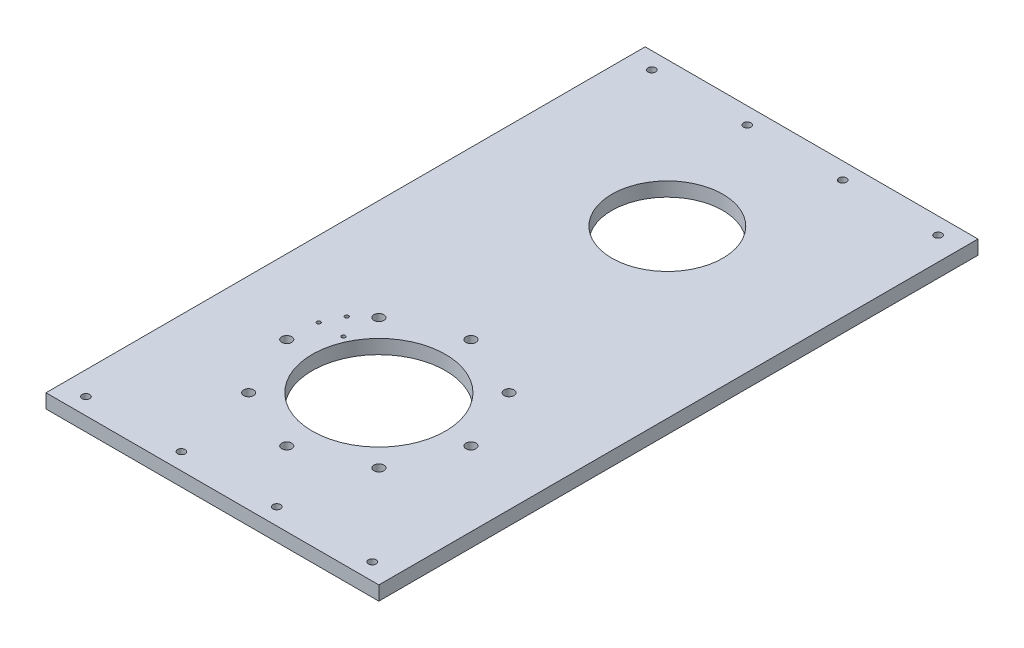
ISO-10303-21;
HEADER;
FILE_DESCRIPTION(('STEP AP214'),'2;1');
FILE_NAME('part.step','',(''),(''),'','','');
FILE_SCHEMA(('AUTOMOTIVE_DESIGN { 1 0 10303 214 1 1 1 1 }'));
ENDSEC;
DATA;
#1=APPLICATION_CONTEXT('core data for automotive mechanical design processes');
#2=APPLICATION_PROTOCOL_DEFINITION('international standard','automotive_design',2000,#1);
#3=PRODUCT_CONTEXT('',#1,'mechanical');
#4=PRODUCT('Part','Part','',(#3));
#5=PRODUCT_RELATED_PRODUCT_CATEGORY('part','',(#4));
#6=PRODUCT_DEFINITION_FORMATION('','',#4);
#7=PRODUCT_DEFINITION_CONTEXT('part definition',#1,'design');
#8=PRODUCT_DEFINITION('design','',#6,#7);
#9=PRODUCT_DEFINITION_SHAPE('','',#8);
#10=(LENGTH_UNIT() NAMED_UNIT(*) SI_UNIT(.MILLI.,.METRE.));
#11=(NAMED_UNIT(*) PLANE_ANGLE_UNIT() SI_UNIT($,.RADIAN.));
#12=(NAMED_UNIT(*) SI_UNIT($,.STERADIAN.) SOLID_ANGLE_UNIT());
#13=UNCERTAINTY_MEASURE_WITH_UNIT(LENGTH_MEASURE(1.E-05),#10,'distance_accuracy_value','');
#14=(GEOMETRIC_REPRESENTATION_CONTEXT(3) GLOBAL_UNCERTAINTY_ASSIGNED_CONTEXT((#13)) GLOBAL_UNIT_ASSIGNED_CONTEXT((#10,
#11,#12)) REPRESENTATION_CONTEXT('',''));
#15=CARTESIAN_POINT('',(0.,0.,0.));
#16=DIRECTION('',(0.,0.,1.));
#17=DIRECTION('',(1.,0.,0.));
#18=AXIS2_PLACEMENT_3D('',#15,#16,#17);
#19=CARTESIAN_POINT('',(75.,6.35,135.));
#20=DIRECTION('',(-1.,0.,0.));
#21=DIRECTION('',(0.,0.,1.));
#22=AXIS2_PLACEMENT_3D('',#19,#20,#21);
#23=PLANE('',#22);
#24=DIRECTION('',(0.,0.,-1.));
#25=VECTOR('',#24,1.);
#26=CARTESIAN_POINT('',(75.,0.,135.));
#27=LINE('',#26,#25);
#28=CARTESIAN_POINT('',(75.,0.,135.));
#29=VERTEX_POINT('',#28);
#30=CARTESIAN_POINT('',(75.,0.,-135.));
#31=VERTEX_POINT('',#30);
#32=EDGE_CURVE('E106',#29,#31,#27,.T.);
#33=ORIENTED_EDGE('',*,*,#32,.T.);
#34=DIRECTION('',(0.,-1.,0.));
#35=VECTOR('',#34,1.);
#36=CARTESIAN_POINT('',(75.,6.35,-135.));
#37=LINE('',#36,#35);
#38=CARTESIAN_POINT('',(75.,6.35,-135.));
#39=VERTEX_POINT('',#38);
#40=EDGE_CURVE('E11',#39,#31,#37,.T.);
#41=ORIENTED_EDGE('',*,*,#40,.F.);
#42=DIRECTION('',(0.,0.,-1.));
#43=VECTOR('',#42,1.);
#44=CARTESIAN_POINT('',(75.,6.35,135.));
#45=LINE('',#44,#43);
#46=CARTESIAN_POINT('',(75.,6.35,135.));
#47=VERTEX_POINT('',#46);
#48=EDGE_CURVE('E94',#47,#39,#45,.T.);
#49=ORIENTED_EDGE('',*,*,#48,.F.);
#50=DIRECTION('',(0.,-1.,0.));
#51=VECTOR('',#50,1.);
#52=CARTESIAN_POINT('',(75.,6.35,135.));
#53=LINE('',#52,#51);
#54=EDGE_CURVE('E102',#47,#29,#53,.T.);
#55=ORIENTED_EDGE('',*,*,#54,.T.);
#56=EDGE_LOOP('',(#33,#41,#49,#55));
#57=FACE_BOUND('',#56,.T.);
#58=ADVANCED_FACE('F43',(#57),#23,.F.);
#59=CARTESIAN_POINT('',(-75.,6.35,-135.));
#60=DIRECTION('',(0.,0.,1.));
#61=DIRECTION('',(1.,0.,0.));
#62=AXIS2_PLACEMENT_3D('',#59,#60,#61);
#63=PLANE('',#62);
#64=DIRECTION('',(-1.,0.,0.));
#65=VECTOR('',#64,1.);
#66=CARTESIAN_POINT('',(-75.,0.,-135.));
#67=LINE('',#66,#65);
#68=CARTESIAN_POINT('',(-75.,0.,-135.));
#69=VERTEX_POINT('',#68);
#70=EDGE_CURVE('E98',#31,#69,#67,.T.);
#71=ORIENTED_EDGE('',*,*,#70,.T.);
#72=DIRECTION('',(0.,-1.,0.));
#73=VECTOR('',#72,1.);
#74=CARTESIAN_POINT('',(-75.,6.35,-135.));
#75=LINE('',#74,#73);
#76=CARTESIAN_POINT('',(-75.,6.35,-135.));
#77=VERTEX_POINT('',#76);
#78=EDGE_CURVE('E51',#77,#69,#75,.T.);
#79=ORIENTED_EDGE('',*,*,#78,.F.);
#80=DIRECTION('',(-1.,0.,0.));
#81=VECTOR('',#80,1.);
#82=CARTESIAN_POINT('',(-75.,6.35,-135.));
#83=LINE('',#82,#81);
#84=EDGE_CURVE('E89',#39,#77,#83,.T.);
#85=ORIENTED_EDGE('',*,*,#84,.F.);
#86=ORIENTED_EDGE('',*,*,#40,.T.);
#87=EDGE_LOOP('',(#71,#79,#85,#86));
#88=FACE_BOUND('',#87,.T.);
#89=ADVANCED_FACE('F97',(#88),#63,.F.);
#90=CARTESIAN_POINT('',(-75.,6.35,135.));
#91=DIRECTION('',(1.,0.,0.));
#92=DIRECTION('',(0.,0.,-1.));
#93=AXIS2_PLACEMENT_3D('',#90,#91,#92);
#94=PLANE('',#93);
#95=DIRECTION('',(0.,0.,1.));
#96=VECTOR('',#95,1.);
#97=CARTESIAN_POINT('',(-75.,0.,135.));
#98=LINE('',#97,#96);
#99=CARTESIAN_POINT('',(-75.,0.,135.));
#100=VERTEX_POINT('',#99);
#101=EDGE_CURVE('E76',#69,#100,#98,.T.);
#102=ORIENTED_EDGE('',*,*,#101,.T.);
#103=DIRECTION('',(0.,-1.,0.));
#104=VECTOR('',#103,1.);
#105=CARTESIAN_POINT('',(-75.,6.35,135.));
#106=LINE('',#105,#104);
#107=CARTESIAN_POINT('',(-75.,6.35,135.));
#108=VERTEX_POINT('',#107);
#109=EDGE_CURVE('E99',#108,#100,#106,.T.);
#110=ORIENTED_EDGE('',*,*,#109,.F.);
#111=DIRECTION('',(0.,0.,1.));
#112=VECTOR('',#111,1.);
#113=CARTESIAN_POINT('',(-75.,6.35,135.));
#114=LINE('',#113,#112);
#115=EDGE_CURVE('E92',#77,#108,#114,.T.);
#116=ORIENTED_EDGE('',*,*,#115,.F.);
#117=ORIENTED_EDGE('',*,*,#78,.T.);
#118=EDGE_LOOP('',(#102,#110,#116,#117));
#119=FACE_BOUND('',#118,.T.);
#120=ADVANCED_FACE('F100',(#119),#94,.F.);
#121=CARTESIAN_POINT('',(-75.,6.35,135.));
#122=DIRECTION('',(0.,0.,-1.));
#123=DIRECTION('',(-1.,0.,0.));
#124=AXIS2_PLACEMENT_3D('',#121,#122,#123);
#125=PLANE('',#124);
#126=DIRECTION('',(1.,0.,0.));
#127=VECTOR('',#126,1.);
#128=CARTESIAN_POINT('',(-75.,0.,135.));
#129=LINE('',#128,#127);
#130=EDGE_CURVE('E82',#100,#29,#129,.T.);
#131=ORIENTED_EDGE('',*,*,#130,.T.);
#132=ORIENTED_EDGE('',*,*,#54,.F.);
#133=DIRECTION('',(1.,0.,0.));
#134=VECTOR('',#133,1.);
#135=CARTESIAN_POINT('',(-75.,6.35,135.));
#136=LINE('',#135,#134);
#137=EDGE_CURVE('E59',#108,#47,#136,.T.);
#138=ORIENTED_EDGE('',*,*,#137,.F.);
#139=ORIENTED_EDGE('',*,*,#109,.T.);
#140=EDGE_LOOP('',(#131,#132,#138,#139));
#141=FACE_BOUND('',#140,.T.);
#142=ADVANCED_FACE('F114',(#141),#125,.F.);
#143=CARTESIAN_POINT('',(0.,6.35,0.));
#144=DIRECTION('',(0.,-1.,0.));
#145=DIRECTION('',(0.,0.,-1.));
#146=AXIS2_PLACEMENT_3D('',#143,#144,#145);
#147=PLANE('',#146);
#148=CARTESIAN_POINT('',(0.,6.35,-70.));
#149=DIRECTION('',(0.,1.,0.));
#150=DIRECTION('',(0.,0.,1.));
#151=AXIS2_PLACEMENT_3D('',#148,#149,#150);
#152=CIRCLE('',#151,25.);
#153=CARTESIAN_POINT('',(0.,6.35,-45.));
#154=VERTEX_POINT('',#153);
#155=EDGE_CURVE('E240',#154,#154,#152,.T.);
#156=ORIENTED_EDGE('',*,*,#155,.F.);
#157=EDGE_LOOP('',(#156));
#158=FACE_BOUND('',#157,.T.);
#159=CARTESIAN_POINT('',(-21.5,6.35,127.5));
#160=DIRECTION('',(0.,1.,0.));
#161=DIRECTION('',(0.,0.,1.));
#162=AXIS2_PLACEMENT_3D('',#159,#160,#161);
#163=CIRCLE('',#162,1.70000000000001);
#164=CARTESIAN_POINT('',(-21.5,6.35,129.2));
#165=VERTEX_POINT('',#164);
#166=EDGE_CURVE('E217',#165,#165,#163,.T.);
#167=ORIENTED_EDGE('',*,*,#166,.F.);
#168=EDGE_LOOP('',(#167));
#169=FACE_BOUND('',#168,.T.);
#170=CARTESIAN_POINT('',(21.5,6.35,127.5));
#171=DIRECTION('',(0.,1.,0.));
#172=DIRECTION('',(0.,0.,-1.));
#173=AXIS2_PLACEMENT_3D('',#170,#171,#172);
#174=CIRCLE('',#173,1.70000000000001);
#175=CARTESIAN_POINT('',(21.5,6.35,125.8));
#176=VERTEX_POINT('',#175);
#177=EDGE_CURVE('E211',#176,#176,#174,.T.);
#178=ORIENTED_EDGE('',*,*,#177,.F.);
#179=EDGE_LOOP('',(#178));
#180=FACE_BOUND('',#179,.T.);
#181=CARTESIAN_POINT('',(64.5,6.35,127.5));
#182=DIRECTION('',(0.,1.,0.));
#183=DIRECTION('',(0.,0.,-1.));
#184=AXIS2_PLACEMENT_3D('',#181,#182,#183);
#185=CIRCLE('',#184,1.70000000000001);
#186=CARTESIAN_POINT('',(64.5,6.35,125.8));
#187=VERTEX_POINT('',#186);
#188=EDGE_CURVE('E205',#187,#187,#185,.T.);
#189=ORIENTED_EDGE('',*,*,#188,.F.);
#190=EDGE_LOOP('',(#189));
#191=FACE_BOUND('',#190,.T.);
#192=CARTESIAN_POINT('',(64.5,6.35,-127.5));
#193=DIRECTION('',(0.,1.,0.));
#194=DIRECTION('',(0.,0.,1.));
#195=AXIS2_PLACEMENT_3D('',#192,#193,#194);
#196=CIRCLE('',#195,1.70000000000001);
#197=CARTESIAN_POINT('',(64.5,6.35,-125.8));
#198=VERTEX_POINT('',#197);
#199=EDGE_CURVE('E198',#198,#198,#196,.T.);
#200=ORIENTED_EDGE('',*,*,#199,.F.);
#201=EDGE_LOOP('',(#200));
#202=FACE_BOUND('',#201,.T.);
#203=CARTESIAN_POINT('',(-21.5,6.35,-127.5));
#204=DIRECTION('',(0.,1.,0.));
#205=DIRECTION('',(0.,0.,-1.));
#206=AXIS2_PLACEMENT_3D('',#203,#204,#205);
#207=CIRCLE('',#206,1.70000000000001);
#208=CARTESIAN_POINT('',(-21.5,6.35,-129.2));
#209=VERTEX_POINT('',#208);
#210=EDGE_CURVE('E234',#209,#209,#207,.T.);
#211=ORIENTED_EDGE('',*,*,#210,.F.);
#212=EDGE_LOOP('',(#211));
#213=FACE_BOUND('',#212,.T.);
#214=CARTESIAN_POINT('',(-64.5,6.35,-127.5));
#215=DIRECTION('',(0.,1.,0.));
#216=DIRECTION('',(0.,0.,-1.));
#217=AXIS2_PLACEMENT_3D('',#214,#215,#216);
#218=CIRCLE('',#217,1.70000000000001);
#219=CARTESIAN_POINT('',(-64.5,6.35,-129.2));
#220=VERTEX_POINT('',#219);
#221=EDGE_CURVE('E222',#220,#220,#218,.T.);
#222=ORIENTED_EDGE('',*,*,#221,.F.);
#223=EDGE_LOOP('',(#222));
#224=FACE_BOUND('',#223,.T.);
#225=CARTESIAN_POINT('',(21.5,6.35,-127.5));
#226=DIRECTION('',(0.,1.,0.));
#227=DIRECTION('',(0.,0.,1.));
#228=AXIS2_PLACEMENT_3D('',#225,#226,#227);
#229=CIRCLE('',#228,1.70000000000001);
#230=CARTESIAN_POINT('',(21.5,6.35,-125.8));
#231=VERTEX_POINT('',#230);
#232=EDGE_CURVE('E229',#231,#231,#229,.T.);
#233=ORIENTED_EDGE('',*,*,#232,.F.);
#234=EDGE_LOOP('',(#233));
#235=FACE_BOUND('',#234,.T.);
#236=CARTESIAN_POINT('',(-64.5,6.35,127.5));
#237=DIRECTION('',(0.,1.,0.));
#238=DIRECTION('',(0.,0.,1.));
#239=AXIS2_PLACEMENT_3D('',#236,#237,#238);
#240=CIRCLE('',#239,1.70000000000001);
#241=CARTESIAN_POINT('',(-64.5,6.35,129.2));
#242=VERTEX_POINT('',#241);
#243=EDGE_CURVE('E192',#242,#242,#240,.T.);
#244=ORIENTED_EDGE('',*,*,#243,.F.);
#245=EDGE_LOOP('',(#244));
#246=FACE_BOUND('',#245,.T.);
#247=CARTESIAN_POINT('',(-40.9786715858443,6.35,46.1323767335741));
#248=DIRECTION('',(0.,1.,0.));
#249=DIRECTION('',(0.,0.,-1.));
#250=AXIS2_PLACEMENT_3D('',#247,#248,#249);
#251=CIRCLE('',#250,0.849999999999999);
#252=CARTESIAN_POINT('',(-40.9786715858443,6.35,45.2823767335741));
#253=VERTEX_POINT('',#252);
#254=EDGE_CURVE('E187',#253,#253,#251,.T.);
#255=ORIENTED_EDGE('',*,*,#254,.F.);
#256=EDGE_LOOP('',(#255));
#257=FACE_BOUND('',#256,.T.);
#258=CARTESIAN_POINT('',(-36.9637980993077,6.35,37.5224527567259));
#259=DIRECTION('',(0.,1.,0.));
#260=DIRECTION('',(0.,0.,1.));
#261=AXIS2_PLACEMENT_3D('',#258,#259,#260);
#262=CIRCLE('',#261,0.849999999999999);
#263=CARTESIAN_POINT('',(-36.9637980993077,6.35,38.3724527567259));
#264=VERTEX_POINT('',#263);
#265=EDGE_CURVE('E181',#264,#264,#262,.T.);
#266=ORIENTED_EDGE('',*,*,#265,.F.);
#267=EDGE_LOOP('',(#266));
#268=FACE_BOUND('',#267,.T.);
#269=CARTESIAN_POINT('',(-29.9081569722095,6.35,46.053597362557));
#270=DIRECTION('',(0.,1.,0.));
#271=DIRECTION('',(0.,0.,1.));
#272=AXIS2_PLACEMENT_3D('',#269,#270,#271);
#273=CIRCLE('',#272,0.850000000000001);
#274=CARTESIAN_POINT('',(-29.9081569722095,6.35,46.903597362557));
#275=VERTEX_POINT('',#274);
#276=EDGE_CURVE('E174',#275,#275,#273,.T.);
#277=ORIENTED_EDGE('',*,*,#276,.F.);
#278=EDGE_LOOP('',(#277));
#279=FACE_BOUND('',#278,.T.);
#280=CARTESIAN_POINT('',(0.,6.35,18.5));
#281=DIRECTION('',(0.,1.,0.));
#282=DIRECTION('',(0.,0.,1.));
#283=AXIS2_PLACEMENT_3D('',#280,#281,#282);
#284=CIRCLE('',#283,2.25);
#285=CARTESIAN_POINT('',(0.,6.35,20.75));
#286=VERTEX_POINT('',#285);
#287=EDGE_CURVE('E127',#286,#286,#284,.T.);
#288=ORIENTED_EDGE('',*,*,#287,.F.);
#289=EDGE_LOOP('',(#288));
#290=FACE_BOUND('',#289,.T.);
#291=CARTESIAN_POINT('',(-29.3449314192417,6.35,30.6550685807583));
#292=DIRECTION('',(0.,1.,0.));
#293=DIRECTION('',(0.,0.,1.));
#294=AXIS2_PLACEMENT_3D('',#291,#292,#293);
#295=CIRCLE('',#294,2.25);
#296=CARTESIAN_POINT('',(-29.3449314192417,6.35,32.9050685807583));
#297=VERTEX_POINT('',#296);
#298=EDGE_CURVE('E146',#297,#297,#295,.T.);
#299=ORIENTED_EDGE('',*,*,#298,.F.);
#300=EDGE_LOOP('',(#299));
#301=FACE_BOUND('',#300,.T.);
#302=CARTESIAN_POINT('',(-41.5,6.35,60.));
#303=DIRECTION('',(0.,1.,0.));
#304=DIRECTION('',(0.,0.,1.));
#305=AXIS2_PLACEMENT_3D('',#302,#303,#304);
#306=CIRCLE('',#305,2.25);
#307=CARTESIAN_POINT('',(-41.5,6.35,62.25));
#308=VERTEX_POINT('',#307);
#309=EDGE_CURVE('E153',#308,#308,#306,.T.);
#310=ORIENTED_EDGE('',*,*,#309,.F.);
#311=EDGE_LOOP('',(#310));
#312=FACE_BOUND('',#311,.T.);
#313=CARTESIAN_POINT('',(-29.3449314192417,6.35,89.3449314192417));
#314=DIRECTION('',(0.,1.,0.));
#315=DIRECTION('',(0.,0.,1.));
#316=AXIS2_PLACEMENT_3D('',#313,#314,#315);
#317=CIRCLE('',#316,2.25);
#318=CARTESIAN_POINT('',(-29.3449314192417,6.35,91.5949314192417));
#319=VERTEX_POINT('',#318);
#320=EDGE_CURVE('E159',#319,#319,#317,.T.);
#321=ORIENTED_EDGE('',*,*,#320,.F.);
#322=EDGE_LOOP('',(#321));
#323=FACE_BOUND('',#322,.T.);
#324=CARTESIAN_POINT('',(0.,6.35,101.5));
#325=DIRECTION('',(0.,1.,0.));
#326=DIRECTION('',(0.,0.,1.));
#327=AXIS2_PLACEMENT_3D('',#324,#325,#326);
#328=CIRCLE('',#327,2.25);
#329=CARTESIAN_POINT('',(0.,6.35,103.75));
#330=VERTEX_POINT('',#329);
#331=EDGE_CURVE('E165',#330,#330,#328,.T.);
#332=ORIENTED_EDGE('',*,*,#331,.F.);
#333=EDGE_LOOP('',(#332));
#334=FACE_BOUND('',#333,.T.);
#335=CARTESIAN_POINT('',(29.3449314192417,6.35,30.6550685807583));
#336=DIRECTION('',(0.,1.,0.));
#337=DIRECTION('',(0.,0.,1.));
#338=AXIS2_PLACEMENT_3D('',#335,#336,#337);
#339=CIRCLE('',#338,2.25000000000002);
#340=CARTESIAN_POINT('',(29.3449314192417,6.35,32.9050685807583));
#341=VERTEX_POINT('',#340);
#342=EDGE_CURVE('E128',#341,#341,#339,.T.);
#343=ORIENTED_EDGE('',*,*,#342,.F.);
#344=EDGE_LOOP('',(#343));
#345=FACE_BOUND('',#344,.T.);
#346=CARTESIAN_POINT('',(0.,6.35,60.));
#347=DIRECTION('',(0.,1.,0.));
#348=DIRECTION('',(0.,0.,1.));
#349=AXIS2_PLACEMENT_3D('',#346,#347,#348);
#350=CIRCLE('',#349,30.);
#351=CARTESIAN_POINT('',(0.,6.35,90.));
#352=VERTEX_POINT('',#351);
#353=EDGE_CURVE('E120',#352,#352,#350,.T.);
#354=ORIENTED_EDGE('',*,*,#353,.F.);
#355=EDGE_LOOP('',(#354));
#356=FACE_BOUND('',#355,.T.);
#357=CARTESIAN_POINT('',(41.5,6.35,60.));
#358=DIRECTION('',(0.,1.,0.));
#359=DIRECTION('',(0.,0.,1.));
#360=AXIS2_PLACEMENT_3D('',#357,#358,#359);
#361=CIRCLE('',#360,2.25);
#362=CARTESIAN_POINT('',(41.5,6.35,62.25));
#363=VERTEX_POINT('',#362);
#364=EDGE_CURVE('E141',#363,#363,#361,.T.);
#365=ORIENTED_EDGE('',*,*,#364,.F.);
#366=EDGE_LOOP('',(#365));
#367=FACE_BOUND('',#366,.T.);
#368=CARTESIAN_POINT('',(29.3449314192417,6.35,89.3449314192417));
#369=DIRECTION('',(0.,1.,0.));
#370=DIRECTION('',(0.,0.,1.));
#371=AXIS2_PLACEMENT_3D('',#368,#369,#370);
#372=CIRCLE('',#371,2.25000000000001);
#373=CARTESIAN_POINT('',(29.3449314192417,6.35,91.5949314192418));
#374=VERTEX_POINT('',#373);
#375=EDGE_CURVE('E134',#374,#374,#372,.T.);
#376=ORIENTED_EDGE('',*,*,#375,.F.);
#377=EDGE_LOOP('',(#376));
#378=FACE_BOUND('',#377,.T.);
#379=ORIENTED_EDGE('',*,*,#48,.T.);
#380=ORIENTED_EDGE('',*,*,#84,.T.);
#381=ORIENTED_EDGE('',*,*,#115,.T.);
#382=ORIENTED_EDGE('',*,*,#137,.T.);
#383=EDGE_LOOP('',(#379,#380,#381,#382));
#384=FACE_BOUND('',#383,.T.);
#385=ADVANCED_FACE('F90',(#158,#169,#180,#191,#202,#213,#224,#235,#246,#257,#268,#279,#290,#301,
#312,#323,#334,#345,#356,#367,#378,#384),#147,.F.);
#386=CARTESIAN_POINT('',(0.,0.,0.));
#387=DIRECTION('',(0.,-1.,0.));
#388=DIRECTION('',(0.,0.,-1.));
#389=AXIS2_PLACEMENT_3D('',#386,#387,#388);
#390=PLANE('',#389);
#391=CARTESIAN_POINT('',(0.,0.,-70.));
#392=DIRECTION('',(0.,1.,0.));
#393=DIRECTION('',(0.,0.,1.));
#394=AXIS2_PLACEMENT_3D('',#391,#392,#393);
#395=CIRCLE('',#394,25.);
#396=CARTESIAN_POINT('',(0.,0.,-45.));
#397=VERTEX_POINT('',#396);
#398=EDGE_CURVE('E237',#397,#397,#395,.T.);
#399=ORIENTED_EDGE('',*,*,#398,.T.);
#400=EDGE_LOOP('',(#399));
#401=FACE_BOUND('',#400,.T.);
#402=CARTESIAN_POINT('',(-21.5,0.,127.5));
#403=DIRECTION('',(0.,1.,0.));
#404=DIRECTION('',(0.,0.,1.));
#405=AXIS2_PLACEMENT_3D('',#402,#403,#404);
#406=CIRCLE('',#405,1.70000000000001);
#407=CARTESIAN_POINT('',(-21.5,0.,129.2));
#408=VERTEX_POINT('',#407);
#409=EDGE_CURVE('E195',#408,#408,#406,.T.);
#410=ORIENTED_EDGE('',*,*,#409,.T.);
#411=EDGE_LOOP('',(#410));
#412=FACE_BOUND('',#411,.T.);
#413=CARTESIAN_POINT('',(21.5,0.,127.5));
#414=DIRECTION('',(0.,1.,0.));
#415=DIRECTION('',(0.,0.,-1.));
#416=AXIS2_PLACEMENT_3D('',#413,#414,#415);
#417=CIRCLE('',#416,1.70000000000001);
#418=CARTESIAN_POINT('',(21.5,0.,125.8));
#419=VERTEX_POINT('',#418);
#420=EDGE_CURVE('E214',#419,#419,#417,.T.);
#421=ORIENTED_EDGE('',*,*,#420,.T.);
#422=EDGE_LOOP('',(#421));
#423=FACE_BOUND('',#422,.T.);
#424=CARTESIAN_POINT('',(64.5,0.,127.5));
#425=DIRECTION('',(0.,1.,0.));
#426=DIRECTION('',(0.,0.,-1.));
#427=AXIS2_PLACEMENT_3D('',#424,#425,#426);
#428=CIRCLE('',#427,1.70000000000001);
#429=CARTESIAN_POINT('',(64.5,0.,125.8));
#430=VERTEX_POINT('',#429);
#431=EDGE_CURVE('E208',#430,#430,#428,.T.);
#432=ORIENTED_EDGE('',*,*,#431,.T.);
#433=EDGE_LOOP('',(#432));
#434=FACE_BOUND('',#433,.T.);
#435=CARTESIAN_POINT('',(64.5,0.,-127.5));
#436=DIRECTION('',(0.,1.,0.));
#437=DIRECTION('',(0.,0.,1.));
#438=AXIS2_PLACEMENT_3D('',#435,#436,#437);
#439=CIRCLE('',#438,1.70000000000001);
#440=CARTESIAN_POINT('',(64.5,0.,-125.8));
#441=VERTEX_POINT('',#440);
#442=EDGE_CURVE('E201',#441,#441,#439,.T.);
#443=ORIENTED_EDGE('',*,*,#442,.T.);
#444=EDGE_LOOP('',(#443));
#445=FACE_BOUND('',#444,.T.);
#446=CARTESIAN_POINT('',(-21.5,0.,-127.5));
#447=DIRECTION('',(0.,1.,0.));
#448=DIRECTION('',(0.,0.,-1.));
#449=AXIS2_PLACEMENT_3D('',#446,#447,#448);
#450=CIRCLE('',#449,1.70000000000001);
#451=CARTESIAN_POINT('',(-21.5,0.,-129.2));
#452=VERTEX_POINT('',#451);
#453=EDGE_CURVE('E226',#452,#452,#450,.T.);
#454=ORIENTED_EDGE('',*,*,#453,.T.);
#455=EDGE_LOOP('',(#454));
#456=FACE_BOUND('',#455,.T.);
#457=CARTESIAN_POINT('',(-64.5,0.,-127.5));
#458=DIRECTION('',(0.,1.,0.));
#459=DIRECTION('',(0.,0.,-1.));
#460=AXIS2_PLACEMENT_3D('',#457,#458,#459);
#461=CIRCLE('',#460,1.70000000000001);
#462=CARTESIAN_POINT('',(-64.5,0.,-129.2));
#463=VERTEX_POINT('',#462);
#464=EDGE_CURVE('E225',#463,#463,#461,.T.);
#465=ORIENTED_EDGE('',*,*,#464,.T.);
#466=EDGE_LOOP('',(#465));
#467=FACE_BOUND('',#466,.T.);
#468=CARTESIAN_POINT('',(21.5,0.,-127.5));
#469=DIRECTION('',(0.,1.,0.));
#470=DIRECTION('',(0.,0.,1.));
#471=AXIS2_PLACEMENT_3D('',#468,#469,#470);
#472=CIRCLE('',#471,1.70000000000001);
#473=CARTESIAN_POINT('',(21.5,0.,-125.8));
#474=VERTEX_POINT('',#473);
#475=EDGE_CURVE('E202',#474,#474,#472,.T.);
#476=ORIENTED_EDGE('',*,*,#475,.T.);
#477=EDGE_LOOP('',(#476));
#478=FACE_BOUND('',#477,.T.);
#479=CARTESIAN_POINT('',(-64.5,0.,127.5));
#480=DIRECTION('',(0.,1.,0.));
#481=DIRECTION('',(0.,0.,1.));
#482=AXIS2_PLACEMENT_3D('',#479,#480,#481);
#483=CIRCLE('',#482,1.70000000000001);
#484=CARTESIAN_POINT('',(-64.5,0.,129.2));
#485=VERTEX_POINT('',#484);
#486=EDGE_CURVE('E178',#485,#485,#483,.T.);
#487=ORIENTED_EDGE('',*,*,#486,.T.);
#488=EDGE_LOOP('',(#487));
#489=FACE_BOUND('',#488,.T.);
#490=CARTESIAN_POINT('',(-40.9786715858443,0.,46.1323767335741));
#491=DIRECTION('',(0.,1.,0.));
#492=DIRECTION('',(0.,0.,-1.));
#493=AXIS2_PLACEMENT_3D('',#490,#491,#492);
#494=CIRCLE('',#493,0.849999999999999);
#495=CARTESIAN_POINT('',(-40.9786715858443,0.,45.2823767335741));
#496=VERTEX_POINT('',#495);
#497=EDGE_CURVE('E150',#496,#496,#494,.T.);
#498=ORIENTED_EDGE('',*,*,#497,.T.);
#499=EDGE_LOOP('',(#498));
#500=FACE_BOUND('',#499,.T.);
#501=CARTESIAN_POINT('',(-36.9637980993077,0.,37.5224527567259));
#502=DIRECTION('',(0.,1.,0.));
#503=DIRECTION('',(0.,0.,1.));
#504=AXIS2_PLACEMENT_3D('',#501,#502,#503);
#505=CIRCLE('',#504,0.849999999999999);
#506=CARTESIAN_POINT('',(-36.9637980993077,0.,38.3724527567259));
#507=VERTEX_POINT('',#506);
#508=EDGE_CURVE('E184',#507,#507,#505,.T.);
#509=ORIENTED_EDGE('',*,*,#508,.T.);
#510=EDGE_LOOP('',(#509));
#511=FACE_BOUND('',#510,.T.);
#512=CARTESIAN_POINT('',(-29.9081569722095,0.,46.053597362557));
#513=DIRECTION('',(0.,1.,0.));
#514=DIRECTION('',(0.,0.,1.));
#515=AXIS2_PLACEMENT_3D('',#512,#513,#514);
#516=CIRCLE('',#515,0.850000000000001);
#517=CARTESIAN_POINT('',(-29.9081569722095,0.,46.903597362557));
#518=VERTEX_POINT('',#517);
#519=EDGE_CURVE('E177',#518,#518,#516,.T.);
#520=ORIENTED_EDGE('',*,*,#519,.T.);
#521=EDGE_LOOP('',(#520));
#522=FACE_BOUND('',#521,.T.);
#523=CARTESIAN_POINT('',(0.,0.,18.5));
#524=DIRECTION('',(0.,1.,0.));
#525=DIRECTION('',(0.,0.,1.));
#526=AXIS2_PLACEMENT_3D('',#523,#524,#525);
#527=CIRCLE('',#526,2.25);
#528=CARTESIAN_POINT('',(0.,0.,20.75));
#529=VERTEX_POINT('',#528);
#530=EDGE_CURVE('E109',#529,#529,#527,.T.);
#531=ORIENTED_EDGE('',*,*,#530,.T.);
#532=EDGE_LOOP('',(#531));
#533=FACE_BOUND('',#532,.T.);
#534=CARTESIAN_POINT('',(-29.3449314192417,0.,30.6550685807583));
#535=DIRECTION('',(0.,1.,0.));
#536=DIRECTION('',(0.,0.,1.));
#537=AXIS2_PLACEMENT_3D('',#534,#535,#536);
#538=CIRCLE('',#537,2.25);
#539=CARTESIAN_POINT('',(-29.3449314192417,0.,32.9050685807583));
#540=VERTEX_POINT('',#539);
#541=EDGE_CURVE('E149',#540,#540,#538,.T.);
#542=ORIENTED_EDGE('',*,*,#541,.T.);
#543=EDGE_LOOP('',(#542));
#544=FACE_BOUND('',#543,.T.);
#545=CARTESIAN_POINT('',(-41.5,0.,60.));
#546=DIRECTION('',(0.,1.,0.));
#547=DIRECTION('',(0.,0.,1.));
#548=AXIS2_PLACEMENT_3D('',#545,#546,#547);
#549=CIRCLE('',#548,2.25);
#550=CARTESIAN_POINT('',(-41.5,0.,62.25));
#551=VERTEX_POINT('',#550);
#552=EDGE_CURVE('E156',#551,#551,#549,.T.);
#553=ORIENTED_EDGE('',*,*,#552,.T.);
#554=EDGE_LOOP('',(#553));
#555=FACE_BOUND('',#554,.T.);
#556=CARTESIAN_POINT('',(-29.3449314192417,0.,89.3449314192417));
#557=DIRECTION('',(0.,1.,0.));
#558=DIRECTION('',(0.,0.,1.));
#559=AXIS2_PLACEMENT_3D('',#556,#557,#558);
#560=CIRCLE('',#559,2.25);
#561=CARTESIAN_POINT('',(-29.3449314192417,0.,91.5949314192417));
#562=VERTEX_POINT('',#561);
#563=EDGE_CURVE('E162',#562,#562,#560,.T.);
#564=ORIENTED_EDGE('',*,*,#563,.T.);
#565=EDGE_LOOP('',(#564));
#566=FACE_BOUND('',#565,.T.);
#567=CARTESIAN_POINT('',(0.,0.,101.5));
#568=DIRECTION('',(0.,1.,0.));
#569=DIRECTION('',(0.,0.,1.));
#570=AXIS2_PLACEMENT_3D('',#567,#568,#569);
#571=CIRCLE('',#570,2.25);
#572=CARTESIAN_POINT('',(0.,0.,103.75));
#573=VERTEX_POINT('',#572);
#574=EDGE_CURVE('E138',#573,#573,#571,.T.);
#575=ORIENTED_EDGE('',*,*,#574,.T.);
#576=EDGE_LOOP('',(#575));
#577=FACE_BOUND('',#576,.T.);
#578=CARTESIAN_POINT('',(29.3449314192417,0.,30.6550685807583));
#579=DIRECTION('',(0.,1.,0.));
#580=DIRECTION('',(0.,0.,1.));
#581=AXIS2_PLACEMENT_3D('',#578,#579,#580);
#582=CIRCLE('',#581,2.25000000000002);
#583=CARTESIAN_POINT('',(29.3449314192417,0.,32.9050685807583));
#584=VERTEX_POINT('',#583);
#585=EDGE_CURVE('E124',#584,#584,#582,.T.);
#586=ORIENTED_EDGE('',*,*,#585,.T.);
#587=EDGE_LOOP('',(#586));
#588=FACE_BOUND('',#587,.T.);
#589=CARTESIAN_POINT('',(0.,0.,60.));
#590=DIRECTION('',(0.,1.,0.));
#591=DIRECTION('',(0.,0.,1.));
#592=AXIS2_PLACEMENT_3D('',#589,#590,#591);
#593=CIRCLE('',#592,30.);
#594=CARTESIAN_POINT('',(0.,0.,90.));
#595=VERTEX_POINT('',#594);
#596=EDGE_CURVE('E123',#595,#595,#593,.T.);
#597=ORIENTED_EDGE('',*,*,#596,.T.);
#598=EDGE_LOOP('',(#597));
#599=FACE_BOUND('',#598,.T.);
#600=CARTESIAN_POINT('',(41.5,0.,60.));
#601=DIRECTION('',(0.,1.,0.));
#602=DIRECTION('',(0.,0.,1.));
#603=AXIS2_PLACEMENT_3D('',#600,#601,#602);
#604=CIRCLE('',#603,2.25);
#605=CARTESIAN_POINT('',(41.5,0.,62.25));
#606=VERTEX_POINT('',#605);
#607=EDGE_CURVE('E131',#606,#606,#604,.T.);
#608=ORIENTED_EDGE('',*,*,#607,.T.);
#609=EDGE_LOOP('',(#608));
#610=FACE_BOUND('',#609,.T.);
#611=CARTESIAN_POINT('',(29.3449314192417,0.,89.3449314192417));
#612=DIRECTION('',(0.,1.,0.));
#613=DIRECTION('',(0.,0.,1.));
#614=AXIS2_PLACEMENT_3D('',#611,#612,#613);
#615=CIRCLE('',#614,2.25000000000001);
#616=CARTESIAN_POINT('',(29.3449314192417,0.,91.5949314192418));
#617=VERTEX_POINT('',#616);
#618=EDGE_CURVE('E137',#617,#617,#615,.T.);
#619=ORIENTED_EDGE('',*,*,#618,.T.);
#620=EDGE_LOOP('',(#619));
#621=FACE_BOUND('',#620,.T.);
#622=ORIENTED_EDGE('',*,*,#32,.F.);
#623=ORIENTED_EDGE('',*,*,#130,.F.);
#624=ORIENTED_EDGE('',*,*,#101,.F.);
#625=ORIENTED_EDGE('',*,*,#70,.F.);
#626=EDGE_LOOP('',(#622,#623,#624,#625));
#627=FACE_BOUND('',#626,.T.);
#628=ADVANCED_FACE('F117',(#401,#412,#423,#434,#445,#456,#467,#478,#489,#500,#511,#522,#533,
#544,#555,#566,#577,#588,#599,#610,#621,#627),#390,.T.);
#629=CARTESIAN_POINT('',(29.3449314192417,0.,89.3449314192417));
#630=DIRECTION('',(0.,1.,0.));
#631=DIRECTION('',(0.,0.,1.));
#632=AXIS2_PLACEMENT_3D('',#629,#630,#631);
#633=CYLINDRICAL_SURFACE('',#632,2.25000000000001);
#634=ORIENTED_EDGE('',*,*,#618,.F.);
#635=EDGE_LOOP('',(#634));
#636=FACE_BOUND('',#635,.T.);
#637=ORIENTED_EDGE('',*,*,#375,.T.);
#638=EDGE_LOOP('',(#637));
#639=FACE_BOUND('',#638,.T.);
#640=ADVANCED_FACE('F298',(#636,#639),#633,.F.);
#641=CARTESIAN_POINT('',(41.5,0.,60.));
#642=DIRECTION('',(0.,1.,0.));
#643=DIRECTION('',(0.,0.,1.));
#644=AXIS2_PLACEMENT_3D('',#641,#642,#643);
#645=CYLINDRICAL_SURFACE('',#644,2.25);
#646=ORIENTED_EDGE('',*,*,#607,.F.);
#647=EDGE_LOOP('',(#646));
#648=FACE_BOUND('',#647,.T.);
#649=ORIENTED_EDGE('',*,*,#364,.T.);
#650=EDGE_LOOP('',(#649));
#651=FACE_BOUND('',#650,.T.);
#652=ADVANCED_FACE('F300',(#648,#651),#645,.F.);
#653=CARTESIAN_POINT('',(0.,0.,60.));
#654=DIRECTION('',(0.,1.,0.));
#655=DIRECTION('',(0.,0.,1.));
#656=AXIS2_PLACEMENT_3D('',#653,#654,#655);
#657=CYLINDRICAL_SURFACE('',#656,30.);
#658=ORIENTED_EDGE('',*,*,#596,.F.);
#659=EDGE_LOOP('',(#658));
#660=FACE_BOUND('',#659,.T.);
#661=ORIENTED_EDGE('',*,*,#353,.T.);
#662=EDGE_LOOP('',(#661));
#663=FACE_BOUND('',#662,.T.);
#664=ADVANCED_FACE('F307',(#660,#663),#657,.F.);
#665=CARTESIAN_POINT('',(29.3449314192417,0.,30.6550685807583));
#666=DIRECTION('',(0.,1.,0.));
#667=DIRECTION('',(0.,0.,1.));
#668=AXIS2_PLACEMENT_3D('',#665,#666,#667);
#669=CYLINDRICAL_SURFACE('',#668,2.25000000000002);
#670=ORIENTED_EDGE('',*,*,#585,.F.);
#671=EDGE_LOOP('',(#670));
#672=FACE_BOUND('',#671,.T.);
#673=ORIENTED_EDGE('',*,*,#342,.T.);
#674=EDGE_LOOP('',(#673));
#675=FACE_BOUND('',#674,.T.);
#676=ADVANCED_FACE('F325',(#672,#675),#669,.F.);
#677=CARTESIAN_POINT('',(0.,0.,101.5));
#678=DIRECTION('',(0.,1.,0.));
#679=DIRECTION('',(0.,0.,1.));
#680=AXIS2_PLACEMENT_3D('',#677,#678,#679);
#681=CYLINDRICAL_SURFACE('',#680,2.25);
#682=ORIENTED_EDGE('',*,*,#574,.F.);
#683=EDGE_LOOP('',(#682));
#684=FACE_BOUND('',#683,.T.);
#685=ORIENTED_EDGE('',*,*,#331,.T.);
#686=EDGE_LOOP('',(#685));
#687=FACE_BOUND('',#686,.T.);
#688=ADVANCED_FACE('F328',(#684,#687),#681,.F.);
#689=CARTESIAN_POINT('',(-29.3449314192417,0.,89.3449314192417));
#690=DIRECTION('',(0.,1.,0.));
#691=DIRECTION('',(0.,0.,1.));
#692=AXIS2_PLACEMENT_3D('',#689,#690,#691);
#693=CYLINDRICAL_SURFACE('',#692,2.25);
#694=ORIENTED_EDGE('',*,*,#563,.F.);
#695=EDGE_LOOP('',(#694));
#696=FACE_BOUND('',#695,.T.);
#697=ORIENTED_EDGE('',*,*,#320,.T.);
#698=EDGE_LOOP('',(#697));
#699=FACE_BOUND('',#698,.T.);
#700=ADVANCED_FACE('F333',(#696,#699),#693,.F.);
#701=CARTESIAN_POINT('',(-41.5,0.,60.));
#702=DIRECTION('',(0.,1.,0.));
#703=DIRECTION('',(0.,0.,1.));
#704=AXIS2_PLACEMENT_3D('',#701,#702,#703);
#705=CYLINDRICAL_SURFACE('',#704,2.25);
#706=ORIENTED_EDGE('',*,*,#552,.F.);
#707=EDGE_LOOP('',(#706));
#708=FACE_BOUND('',#707,.T.);
#709=ORIENTED_EDGE('',*,*,#309,.T.);
#710=EDGE_LOOP('',(#709));
#711=FACE_BOUND('',#710,.T.);
#712=ADVANCED_FACE('F349',(#708,#711),#705,.F.);
#713=CARTESIAN_POINT('',(-29.3449314192417,0.,30.6550685807583));
#714=DIRECTION('',(0.,1.,0.));
#715=DIRECTION('',(0.,0.,1.));
#716=AXIS2_PLACEMENT_3D('',#713,#714,#715);
#717=CYLINDRICAL_SURFACE('',#716,2.25);
#718=ORIENTED_EDGE('',*,*,#541,.F.);
#719=EDGE_LOOP('',(#718));
#720=FACE_BOUND('',#719,.T.);
#721=ORIENTED_EDGE('',*,*,#298,.T.);
#722=EDGE_LOOP('',(#721));
#723=FACE_BOUND('',#722,.T.);
#724=ADVANCED_FACE('F360',(#720,#723),#717,.F.);
#725=CARTESIAN_POINT('',(0.,0.,18.5));
#726=DIRECTION('',(0.,1.,0.));
#727=DIRECTION('',(0.,0.,1.));
#728=AXIS2_PLACEMENT_3D('',#725,#726,#727);
#729=CYLINDRICAL_SURFACE('',#728,2.25);
#730=ORIENTED_EDGE('',*,*,#530,.F.);
#731=EDGE_LOOP('',(#730));
#732=FACE_BOUND('',#731,.T.);
#733=ORIENTED_EDGE('',*,*,#287,.T.);
#734=EDGE_LOOP('',(#733));
#735=FACE_BOUND('',#734,.T.);
#736=ADVANCED_FACE('F355',(#732,#735),#729,.F.);
#737=CARTESIAN_POINT('',(-29.9081569722095,0.,46.053597362557));
#738=DIRECTION('',(0.,1.,0.));
#739=DIRECTION('',(0.,0.,1.));
#740=AXIS2_PLACEMENT_3D('',#737,#738,#739);
#741=CYLINDRICAL_SURFACE('',#740,0.850000000000001);
#742=ORIENTED_EDGE('',*,*,#519,.F.);
#743=EDGE_LOOP('',(#742));
#744=FACE_BOUND('',#743,.T.);
#745=ORIENTED_EDGE('',*,*,#276,.T.);
#746=EDGE_LOOP('',(#745));
#747=FACE_BOUND('',#746,.T.);
#748=ADVANCED_FACE('F367',(#744,#747),#741,.F.);
#749=CARTESIAN_POINT('',(-36.9637980993077,0.,37.5224527567259));
#750=DIRECTION('',(0.,1.,0.));
#751=DIRECTION('',(0.,0.,1.));
#752=AXIS2_PLACEMENT_3D('',#749,#750,#751);
#753=CYLINDRICAL_SURFACE('',#752,0.849999999999999);
#754=ORIENTED_EDGE('',*,*,#508,.F.);
#755=EDGE_LOOP('',(#754));
#756=FACE_BOUND('',#755,.T.);
#757=ORIENTED_EDGE('',*,*,#265,.T.);
#758=EDGE_LOOP('',(#757));
#759=FACE_BOUND('',#758,.T.);
#760=ADVANCED_FACE('F382',(#756,#759),#753,.F.);
#761=CARTESIAN_POINT('',(-40.9786715858443,0.,46.1323767335741));
#762=DIRECTION('',(0.,1.,0.));
#763=DIRECTION('',(0.,0.,1.));
#764=AXIS2_PLACEMENT_3D('',#761,#762,#763);
#765=CYLINDRICAL_SURFACE('',#764,0.849999999999999);
#766=ORIENTED_EDGE('',*,*,#497,.F.);
#767=EDGE_LOOP('',(#766));
#768=FACE_BOUND('',#767,.T.);
#769=ORIENTED_EDGE('',*,*,#254,.T.);
#770=EDGE_LOOP('',(#769));
#771=FACE_BOUND('',#770,.T.);
#772=ADVANCED_FACE('F390',(#768,#771),#765,.F.);
#773=CARTESIAN_POINT('',(-64.5,0.,127.5));
#774=DIRECTION('',(0.,1.,0.));
#775=DIRECTION('',(0.,0.,1.));
#776=AXIS2_PLACEMENT_3D('',#773,#774,#775);
#777=CYLINDRICAL_SURFACE('',#776,1.70000000000001);
#778=ORIENTED_EDGE('',*,*,#486,.F.);
#779=EDGE_LOOP('',(#778));
#780=FACE_BOUND('',#779,.T.);
#781=ORIENTED_EDGE('',*,*,#243,.T.);
#782=EDGE_LOOP('',(#781));
#783=FACE_BOUND('',#782,.T.);
#784=ADVANCED_FACE('F398',(#780,#783),#777,.F.);
#785=CARTESIAN_POINT('',(21.5,0.,-127.5));
#786=DIRECTION('',(0.,1.,0.));
#787=DIRECTION('',(0.,0.,1.));
#788=AXIS2_PLACEMENT_3D('',#785,#786,#787);
#789=CYLINDRICAL_SURFACE('',#788,1.70000000000001);
#790=ORIENTED_EDGE('',*,*,#475,.F.);
#791=EDGE_LOOP('',(#790));
#792=FACE_BOUND('',#791,.T.);
#793=ORIENTED_EDGE('',*,*,#232,.T.);
#794=EDGE_LOOP('',(#793));
#795=FACE_BOUND('',#794,.T.);
#796=ADVANCED_FACE('F402',(#792,#795),#789,.F.);
#797=CARTESIAN_POINT('',(-64.5,0.,-127.5));
#798=DIRECTION('',(0.,1.,0.));
#799=DIRECTION('',(0.,0.,1.));
#800=AXIS2_PLACEMENT_3D('',#797,#798,#799);
#801=CYLINDRICAL_SURFACE('',#800,1.70000000000001);
#802=ORIENTED_EDGE('',*,*,#464,.F.);
#803=EDGE_LOOP('',(#802));
#804=FACE_BOUND('',#803,.T.);
#805=ORIENTED_EDGE('',*,*,#221,.T.);
#806=EDGE_LOOP('',(#805));
#807=FACE_BOUND('',#806,.T.);
#808=ADVANCED_FACE('F420',(#804,#807),#801,.F.);
#809=CARTESIAN_POINT('',(-21.5,0.,-127.5));
#810=DIRECTION('',(0.,1.,0.));
#811=DIRECTION('',(0.,0.,1.));
#812=AXIS2_PLACEMENT_3D('',#809,#810,#811);
#813=CYLINDRICAL_SURFACE('',#812,1.70000000000001);
#814=ORIENTED_EDGE('',*,*,#453,.F.);
#815=EDGE_LOOP('',(#814));
#816=FACE_BOUND('',#815,.T.);
#817=ORIENTED_EDGE('',*,*,#210,.T.);
#818=EDGE_LOOP('',(#817));
#819=FACE_BOUND('',#818,.T.);
#820=ADVANCED_FACE('F408',(#816,#819),#813,.F.);
#821=CARTESIAN_POINT('',(64.5,0.,-127.5));
#822=DIRECTION('',(0.,1.,0.));
#823=DIRECTION('',(0.,0.,1.));
#824=AXIS2_PLACEMENT_3D('',#821,#822,#823);
#825=CYLINDRICAL_SURFACE('',#824,1.70000000000001);
#826=ORIENTED_EDGE('',*,*,#442,.F.);
#827=EDGE_LOOP('',(#826));
#828=FACE_BOUND('',#827,.T.);
#829=ORIENTED_EDGE('',*,*,#199,.T.);
#830=EDGE_LOOP('',(#829));
#831=FACE_BOUND('',#830,.T.);
#832=ADVANCED_FACE('F404',(#828,#831),#825,.F.);
#833=CARTESIAN_POINT('',(64.5,0.,127.5));
#834=DIRECTION('',(0.,1.,0.));
#835=DIRECTION('',(0.,0.,1.));
#836=AXIS2_PLACEMENT_3D('',#833,#834,#835);
#837=CYLINDRICAL_SURFACE('',#836,1.70000000000001);
#838=ORIENTED_EDGE('',*,*,#431,.F.);
#839=EDGE_LOOP('',(#838));
#840=FACE_BOUND('',#839,.T.);
#841=ORIENTED_EDGE('',*,*,#188,.T.);
#842=EDGE_LOOP('',(#841));
#843=FACE_BOUND('',#842,.T.);
#844=ADVANCED_FACE('F407',(#840,#843),#837,.F.);
#845=CARTESIAN_POINT('',(21.5,0.,127.5));
#846=DIRECTION('',(0.,1.,0.));
#847=DIRECTION('',(0.,0.,1.));
#848=AXIS2_PLACEMENT_3D('',#845,#846,#847);
#849=CYLINDRICAL_SURFACE('',#848,1.70000000000001);
#850=ORIENTED_EDGE('',*,*,#420,.F.);
#851=EDGE_LOOP('',(#850));
#852=FACE_BOUND('',#851,.T.);
#853=ORIENTED_EDGE('',*,*,#177,.T.);
#854=EDGE_LOOP('',(#853));
#855=FACE_BOUND('',#854,.T.);
#856=ADVANCED_FACE('F412',(#852,#855),#849,.F.);
#857=CARTESIAN_POINT('',(-21.5,0.,127.5));
#858=DIRECTION('',(0.,1.,0.));
#859=DIRECTION('',(0.,0.,1.));
#860=AXIS2_PLACEMENT_3D('',#857,#858,#859);
#861=CYLINDRICAL_SURFACE('',#860,1.70000000000001);
#862=ORIENTED_EDGE('',*,*,#409,.F.);
#863=EDGE_LOOP('',(#862));
#864=FACE_BOUND('',#863,.T.);
#865=ORIENTED_EDGE('',*,*,#166,.T.);
#866=EDGE_LOOP('',(#865));
#867=FACE_BOUND('',#866,.T.);
#868=ADVANCED_FACE('F251',(#864,#867),#861,.F.);
#869=CARTESIAN_POINT('',(0.,0.,-70.));
#870=DIRECTION('',(0.,1.,0.));
#871=DIRECTION('',(0.,0.,1.));
#872=AXIS2_PLACEMENT_3D('',#869,#870,#871);
#873=CYLINDRICAL_SURFACE('',#872,25.);
#874=ORIENTED_EDGE('',*,*,#398,.F.);
#875=EDGE_LOOP('',(#874));
#876=FACE_BOUND('',#875,.T.);
#877=ORIENTED_EDGE('',*,*,#155,.T.);
#878=EDGE_LOOP('',(#877));
#879=FACE_BOUND('',#878,.T.);
#880=ADVANCED_FACE('F248',(#876,#879),#873,.F.);
#881=CLOSED_SHELL('',(#58,#89,#120,#142,#385,#628,#640,#652,#664,#676,#688,#700,#712,#724,#736,
#748,#760,#772,#784,#796,#808,#820,#832,#844,#856,#868,#880));
#882=MANIFOLD_SOLID_BREP('B2',#881);
#883=ADVANCED_BREP_SHAPE_REPRESENTATION('',(#18,#882),#14);
#884=SHAPE_DEFINITION_REPRESENTATION(#9,#883);
ENDSEC;
END-ISO-10303-21;
